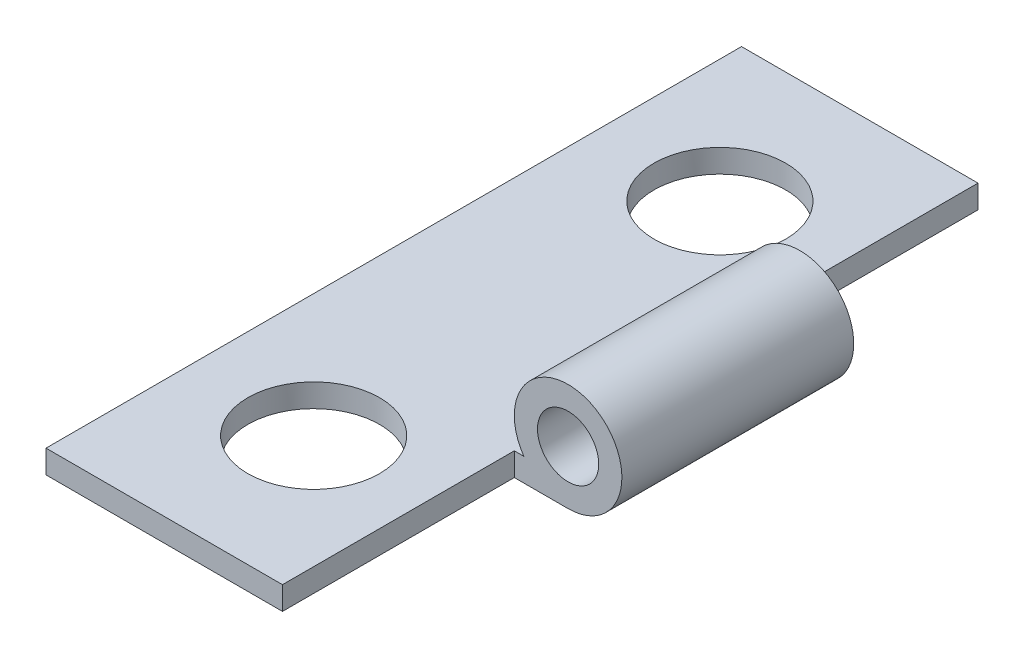
ISO-10303-21;
HEADER;
FILE_DESCRIPTION(('STEP AP214'),'2;1');
FILE_NAME('part.step','',(''),(''),'','','');
FILE_SCHEMA(('AUTOMOTIVE_DESIGN { 1 0 10303 214 1 1 1 1 }'));
ENDSEC;
DATA;
#1=APPLICATION_CONTEXT('core data for automotive mechanical design processes');
#2=APPLICATION_PROTOCOL_DEFINITION('international standard','automotive_design',2000,#1);
#3=PRODUCT_CONTEXT('',#1,'mechanical');
#4=PRODUCT('Part','Part','',(#3));
#5=PRODUCT_RELATED_PRODUCT_CATEGORY('part','',(#4));
#6=PRODUCT_DEFINITION_FORMATION('','',#4);
#7=PRODUCT_DEFINITION_CONTEXT('part definition',#1,'design');
#8=PRODUCT_DEFINITION('design','',#6,#7);
#9=PRODUCT_DEFINITION_SHAPE('','',#8);
#10=(LENGTH_UNIT() NAMED_UNIT(*) SI_UNIT(.MILLI.,.METRE.));
#11=(NAMED_UNIT(*) PLANE_ANGLE_UNIT() SI_UNIT($,.RADIAN.));
#12=(NAMED_UNIT(*) SI_UNIT($,.STERADIAN.) SOLID_ANGLE_UNIT());
#13=UNCERTAINTY_MEASURE_WITH_UNIT(LENGTH_MEASURE(1.E-05),#10,'distance_accuracy_value','');
#14=(GEOMETRIC_REPRESENTATION_CONTEXT(3) GLOBAL_UNCERTAINTY_ASSIGNED_CONTEXT((#13)) GLOBAL_UNIT_ASSIGNED_CONTEXT((#10,
#11,#12)) REPRESENTATION_CONTEXT('',''));
#15=CARTESIAN_POINT('',(0.,0.,0.));
#16=DIRECTION('',(0.,0.,1.));
#17=DIRECTION('',(1.,0.,0.));
#18=AXIS2_PLACEMENT_3D('',#15,#16,#17);
#19=CARTESIAN_POINT('',(-3.0846776,3.10992480641689,19.05));
#20=DIRECTION('',(0.,0.,-1.));
#21=DIRECTION('',(-1.,0.,0.));
#22=AXIS2_PLACEMENT_3D('',#19,#20,#21);
#23=CYLINDRICAL_SURFACE('',#22,1.4732);
#24=CARTESIAN_POINT('',(-3.0846776,3.10992480641689,6.35000000000001));
#25=DIRECTION('',(0.,0.,1.));
#26=DIRECTION('',(1.,0.,0.));
#27=AXIS2_PLACEMENT_3D('',#24,#25,#26);
#28=CIRCLE('',#27,1.4732);
#29=CARTESIAN_POINT('',(-3.0846776,1.63672480641689,6.35000000000001));
#30=VERTEX_POINT('',#29);
#31=CARTESIAN_POINT('',(-4.29618038579952,2.27172480641689,6.35000000000001));
#32=VERTEX_POINT('',#31);
#33=EDGE_CURVE('E140',#30,#32,#28,.T.);
#34=ORIENTED_EDGE('',*,*,#33,.T.);
#35=DIRECTION('',(0.,0.,-1.));
#36=VECTOR('',#35,1.);
#37=CARTESIAN_POINT('',(-4.29618038579952,2.27172480641689,19.05));
#38=LINE('',#37,#36);
#39=CARTESIAN_POINT('',(-4.29618038579952,2.27172480641689,12.7));
#40=VERTEX_POINT('',#39);
#41=EDGE_CURVE('E170',#40,#32,#38,.T.);
#42=ORIENTED_EDGE('',*,*,#41,.F.);
#43=CARTESIAN_POINT('',(-3.0846776,3.10992480641689,12.7));
#44=DIRECTION('',(0.,0.,-1.));
#45=DIRECTION('',(-1.,0.,0.));
#46=AXIS2_PLACEMENT_3D('',#43,#44,#45);
#47=CIRCLE('',#46,1.4732);
#48=CARTESIAN_POINT('',(-3.0846776,1.63672480641689,12.7));
#49=VERTEX_POINT('',#48);
#50=EDGE_CURVE('E63',#40,#49,#47,.T.);
#51=ORIENTED_EDGE('',*,*,#50,.T.);
#52=DIRECTION('',(0.,0.,-1.));
#53=VECTOR('',#52,1.);
#54=CARTESIAN_POINT('',(-3.0846776,1.63672480641689,19.05));
#55=LINE('',#54,#53);
#56=EDGE_CURVE('E129',#49,#30,#55,.T.);
#57=ORIENTED_EDGE('',*,*,#56,.T.);
#58=EDGE_LOOP('',(#34,#42,#51,#57));
#59=FACE_BOUND('',#58,.T.);
#60=ADVANCED_FACE('F39',(#59),#23,.T.);
#61=CARTESIAN_POINT('',(-3.0846776,3.10992480641689,19.05));
#62=DIRECTION('',(0.,0.,1.));
#63=DIRECTION('',(1.,0.,0.));
#64=AXIS2_PLACEMENT_3D('',#61,#62,#63);
#65=PLANE('',#64);
#66=DIRECTION('',(0.,1.,0.));
#67=VECTOR('',#66,1.);
#68=CARTESIAN_POINT('',(-4.5578776,-48.5282751935831,19.05));
#69=LINE('',#68,#67);
#70=CARTESIAN_POINT('',(-4.5578776,1.63672480641688,19.05));
#71=VERTEX_POINT('',#70);
#72=CARTESIAN_POINT('',(-4.5578776,2.27172480641689,19.05));
#73=VERTEX_POINT('',#72);
#74=EDGE_CURVE('E112',#71,#73,#69,.T.);
#75=ORIENTED_EDGE('',*,*,#74,.T.);
#76=DIRECTION('',(-1.,0.,0.));
#77=VECTOR('',#76,1.);
#78=CARTESIAN_POINT('',(-11.0348776,2.27172480641689,19.05));
#79=LINE('',#78,#77);
#80=CARTESIAN_POINT('',(-11.0348776,2.27172480641689,19.05));
#81=VERTEX_POINT('',#80);
#82=EDGE_CURVE('E155',#73,#81,#79,.T.);
#83=ORIENTED_EDGE('',*,*,#82,.T.);
#84=DIRECTION('',(0.,-1.,0.));
#85=VECTOR('',#84,1.);
#86=CARTESIAN_POINT('',(-11.0348776,1.63672480641689,19.05));
#87=LINE('',#86,#85);
#88=CARTESIAN_POINT('',(-11.0348776,1.63672480641689,19.05));
#89=VERTEX_POINT('',#88);
#90=EDGE_CURVE('E158',#81,#89,#87,.T.);
#91=ORIENTED_EDGE('',*,*,#90,.T.);
#92=DIRECTION('',(1.,0.,0.));
#93=VECTOR('',#92,1.);
#94=CARTESIAN_POINT('',(-11.0348776,1.63672480641689,19.05));
#95=LINE('',#94,#93);
#96=EDGE_CURVE('E153',#89,#71,#95,.T.);
#97=ORIENTED_EDGE('',*,*,#96,.T.);
#98=EDGE_LOOP('',(#75,#83,#91,#97));
#99=FACE_BOUND('',#98,.T.);
#100=ADVANCED_FACE('F185',(#99),#65,.T.);
#101=CARTESIAN_POINT('',(-3.0846776,3.10992480641689,0.));
#102=DIRECTION('',(0.,0.,1.));
#103=DIRECTION('',(1.,0.,0.));
#104=AXIS2_PLACEMENT_3D('',#101,#102,#103);
#105=PLANE('',#104);
#106=DIRECTION('',(-1.,0.,0.));
#107=VECTOR('',#106,1.);
#108=CARTESIAN_POINT('',(-11.0348776,2.27172480641689,0.));
#109=LINE('',#108,#107);
#110=CARTESIAN_POINT('',(-4.5578776,2.27172480641689,0.));
#111=VERTEX_POINT('',#110);
#112=CARTESIAN_POINT('',(-11.0348776,2.27172480641689,0.));
#113=VERTEX_POINT('',#112);
#114=EDGE_CURVE('E162',#111,#113,#109,.T.);
#115=ORIENTED_EDGE('',*,*,#114,.F.);
#116=DIRECTION('',(0.,1.,0.));
#117=VECTOR('',#116,1.);
#118=CARTESIAN_POINT('',(-4.5578776,-48.5282751935831,0.));
#119=LINE('',#118,#117);
#120=CARTESIAN_POINT('',(-4.5578776,1.63672480641688,0.));
#121=VERTEX_POINT('',#120);
#122=EDGE_CURVE('E123',#121,#111,#119,.T.);
#123=ORIENTED_EDGE('',*,*,#122,.F.);
#124=DIRECTION('',(1.,0.,0.));
#125=VECTOR('',#124,1.);
#126=CARTESIAN_POINT('',(-11.0348776,1.63672480641689,0.));
#127=LINE('',#126,#125);
#128=CARTESIAN_POINT('',(-11.0348776,1.63672480641689,0.));
#129=VERTEX_POINT('',#128);
#130=EDGE_CURVE('E152',#129,#121,#127,.T.);
#131=ORIENTED_EDGE('',*,*,#130,.F.);
#132=DIRECTION('',(0.,-1.,0.));
#133=VECTOR('',#132,1.);
#134=CARTESIAN_POINT('',(-11.0348776,1.63672480641689,0.));
#135=LINE('',#134,#133);
#136=EDGE_CURVE('E156',#113,#129,#135,.T.);
#137=ORIENTED_EDGE('',*,*,#136,.F.);
#138=EDGE_LOOP('',(#115,#123,#131,#137));
#139=FACE_BOUND('',#138,.T.);
#140=ADVANCED_FACE('F196',(#139),#105,.F.);
#141=CARTESIAN_POINT('',(-11.0348776,1.63672480641689,19.05));
#142=DIRECTION('',(0.,1.,0.));
#143=DIRECTION('',(0.,0.,1.));
#144=AXIS2_PLACEMENT_3D('',#141,#142,#143);
#145=PLANE('',#144);
#146=CARTESIAN_POINT('',(-7.66552899289976,1.63672480641688,15.0876));
#147=DIRECTION('',(0.,1.,0.));
#148=DIRECTION('',(0.,0.,1.));
#149=AXIS2_PLACEMENT_3D('',#146,#147,#148);
#150=CIRCLE('',#149,1.8034);
#151=CARTESIAN_POINT('',(-7.66552899289976,1.63672480641688,16.891));
#152=VERTEX_POINT('',#151);
#153=EDGE_CURVE('E149',#152,#152,#150,.T.);
#154=ORIENTED_EDGE('',*,*,#153,.T.);
#155=EDGE_LOOP('',(#154));
#156=FACE_BOUND('',#155,.T.);
#157=CARTESIAN_POINT('',(-7.66552899289976,1.63672480641688,3.9624));
#158=DIRECTION('',(0.,1.,0.));
#159=DIRECTION('',(0.,0.,1.));
#160=AXIS2_PLACEMENT_3D('',#157,#158,#159);
#161=CIRCLE('',#160,1.8034);
#162=CARTESIAN_POINT('',(-7.66552899289976,1.63672480641688,5.7658));
#163=VERTEX_POINT('',#162);
#164=EDGE_CURVE('E118',#163,#163,#161,.T.);
#165=ORIENTED_EDGE('',*,*,#164,.T.);
#166=EDGE_LOOP('',(#165));
#167=FACE_BOUND('',#166,.T.);
#168=ORIENTED_EDGE('',*,*,#130,.T.);
#169=DIRECTION('',(0.,0.,1.));
#170=VECTOR('',#169,1.);
#171=CARTESIAN_POINT('',(-4.5578776,1.63672480641689,19.05));
#172=LINE('',#171,#170);
#173=CARTESIAN_POINT('',(-4.5578776,1.63672480641688,6.35000000000001));
#174=VERTEX_POINT('',#173);
#175=EDGE_CURVE('E117',#121,#174,#172,.T.);
#176=ORIENTED_EDGE('',*,*,#175,.T.);
#177=DIRECTION('',(1.,0.,0.));
#178=VECTOR('',#177,1.);
#179=CARTESIAN_POINT('',(-11.0348776,1.63672480641689,6.35000000000001));
#180=LINE('',#179,#178);
#181=EDGE_CURVE('E142',#174,#30,#180,.T.);
#182=ORIENTED_EDGE('',*,*,#181,.T.);
#183=ORIENTED_EDGE('',*,*,#56,.F.);
#184=DIRECTION('',(-1.,0.,0.));
#185=VECTOR('',#184,1.);
#186=CARTESIAN_POINT('',(-11.0348776,1.63672480641689,12.7));
#187=LINE('',#186,#185);
#188=CARTESIAN_POINT('',(-4.5578776,1.63672480641688,12.7));
#189=VERTEX_POINT('',#188);
#190=EDGE_CURVE('E121',#49,#189,#187,.T.);
#191=ORIENTED_EDGE('',*,*,#190,.T.);
#192=DIRECTION('',(0.,0.,1.));
#193=VECTOR('',#192,1.);
#194=CARTESIAN_POINT('',(-4.5578776,1.63672480641689,19.05));
#195=LINE('',#194,#193);
#196=EDGE_CURVE('E106',#189,#71,#195,.T.);
#197=ORIENTED_EDGE('',*,*,#196,.T.);
#198=ORIENTED_EDGE('',*,*,#96,.F.);
#199=DIRECTION('',(0.,0.,-1.));
#200=VECTOR('',#199,1.);
#201=CARTESIAN_POINT('',(-11.0348776,1.63672480641689,19.05));
#202=LINE('',#201,#200);
#203=EDGE_CURVE('E160',#89,#129,#202,.T.);
#204=ORIENTED_EDGE('',*,*,#203,.T.);
#205=EDGE_LOOP('',(#168,#176,#182,#183,#191,#197,#198,#204));
#206=FACE_BOUND('',#205,.T.);
#207=ADVANCED_FACE('F41',(#156,#167,#206),#145,.F.);
#208=CARTESIAN_POINT('',(-11.0348776,2.27172480641689,19.05));
#209=DIRECTION('',(0.,-1.,0.));
#210=DIRECTION('',(0.,0.,-1.));
#211=AXIS2_PLACEMENT_3D('',#208,#209,#210);
#212=PLANE('',#211);
#213=CARTESIAN_POINT('',(-7.66552899289976,2.27172480641689,15.0876));
#214=DIRECTION('',(0.,-1.,0.));
#215=DIRECTION('',(0.,0.,-1.));
#216=AXIS2_PLACEMENT_3D('',#213,#214,#215);
#217=CIRCLE('',#216,1.8034);
#218=CARTESIAN_POINT('',(-7.66552899289976,2.27172480641689,13.2842));
#219=VERTEX_POINT('',#218);
#220=EDGE_CURVE('E43',#219,#219,#217,.T.);
#221=ORIENTED_EDGE('',*,*,#220,.T.);
#222=EDGE_LOOP('',(#221));
#223=FACE_BOUND('',#222,.T.);
#224=CARTESIAN_POINT('',(-7.66552899289976,2.27172480641689,3.9624));
#225=DIRECTION('',(0.,-1.,0.));
#226=DIRECTION('',(0.,0.,-1.));
#227=AXIS2_PLACEMENT_3D('',#224,#225,#226);
#228=CIRCLE('',#227,1.8034);
#229=CARTESIAN_POINT('',(-7.66552899289976,2.27172480641689,2.159));
#230=VERTEX_POINT('',#229);
#231=EDGE_CURVE('E144',#230,#230,#228,.T.);
#232=ORIENTED_EDGE('',*,*,#231,.T.);
#233=EDGE_LOOP('',(#232));
#234=FACE_BOUND('',#233,.T.);
#235=DIRECTION('',(-1.,0.,0.));
#236=VECTOR('',#235,1.);
#237=CARTESIAN_POINT('',(-11.0348776,2.27172480641689,6.35000000000001));
#238=LINE('',#237,#236);
#239=CARTESIAN_POINT('',(-4.5578776,2.27172480641689,6.35000000000001));
#240=VERTEX_POINT('',#239);
#241=EDGE_CURVE('E133',#32,#240,#238,.T.);
#242=ORIENTED_EDGE('',*,*,#241,.T.);
#243=DIRECTION('',(0.,0.,-1.));
#244=VECTOR('',#243,1.);
#245=CARTESIAN_POINT('',(-4.5578776,2.27172480641689,19.05));
#246=LINE('',#245,#244);
#247=EDGE_CURVE('E11',#240,#111,#246,.T.);
#248=ORIENTED_EDGE('',*,*,#247,.T.);
#249=ORIENTED_EDGE('',*,*,#114,.T.);
#250=DIRECTION('',(0.,0.,-1.));
#251=VECTOR('',#250,1.);
#252=CARTESIAN_POINT('',(-11.0348776,2.27172480641689,19.05));
#253=LINE('',#252,#251);
#254=EDGE_CURVE('E167',#81,#113,#253,.T.);
#255=ORIENTED_EDGE('',*,*,#254,.F.);
#256=ORIENTED_EDGE('',*,*,#82,.F.);
#257=DIRECTION('',(0.,0.,-1.));
#258=VECTOR('',#257,1.);
#259=CARTESIAN_POINT('',(-4.5578776,2.27172480641689,19.05));
#260=LINE('',#259,#258);
#261=CARTESIAN_POINT('',(-4.5578776,2.27172480641689,12.7));
#262=VERTEX_POINT('',#261);
#263=EDGE_CURVE('E48',#73,#262,#260,.T.);
#264=ORIENTED_EDGE('',*,*,#263,.T.);
#265=DIRECTION('',(1.,0.,0.));
#266=VECTOR('',#265,1.);
#267=CARTESIAN_POINT('',(-11.0348776,2.27172480641689,12.7));
#268=LINE('',#267,#266);
#269=EDGE_CURVE('E122',#262,#40,#268,.T.);
#270=ORIENTED_EDGE('',*,*,#269,.T.);
#271=ORIENTED_EDGE('',*,*,#41,.T.);
#272=EDGE_LOOP('',(#242,#248,#249,#255,#256,#264,#270,#271));
#273=FACE_BOUND('',#272,.T.);
#274=ADVANCED_FACE('F181',(#223,#234,#273),#212,.F.);
#275=CARTESIAN_POINT('',(-11.0348776,1.63672480641689,19.05));
#276=DIRECTION('',(1.,0.,0.));
#277=DIRECTION('',(0.,0.,-1.));
#278=AXIS2_PLACEMENT_3D('',#275,#276,#277);
#279=PLANE('',#278);
#280=ORIENTED_EDGE('',*,*,#136,.T.);
#281=ORIENTED_EDGE('',*,*,#203,.F.);
#282=ORIENTED_EDGE('',*,*,#90,.F.);
#283=ORIENTED_EDGE('',*,*,#254,.T.);
#284=EDGE_LOOP('',(#280,#281,#282,#283));
#285=FACE_BOUND('',#284,.T.);
#286=ADVANCED_FACE('F199',(#285),#279,.F.);
#287=CARTESIAN_POINT('',(-4.5578776,-48.5282751935831,19.05));
#288=DIRECTION('',(-1.,0.,0.));
#289=DIRECTION('',(0.,0.,1.));
#290=AXIS2_PLACEMENT_3D('',#287,#288,#289);
#291=PLANE('',#290);
#292=DIRECTION('',(0.,1.,0.));
#293=VECTOR('',#292,1.);
#294=CARTESIAN_POINT('',(-4.5578776,-48.5282751935831,12.7));
#295=LINE('',#294,#293);
#296=EDGE_CURVE('E109',#189,#262,#295,.T.);
#297=ORIENTED_EDGE('',*,*,#296,.T.);
#298=ORIENTED_EDGE('',*,*,#263,.F.);
#299=ORIENTED_EDGE('',*,*,#74,.F.);
#300=ORIENTED_EDGE('',*,*,#196,.F.);
#301=EDGE_LOOP('',(#297,#298,#299,#300));
#302=FACE_BOUND('',#301,.T.);
#303=ADVANCED_FACE('F108',(#302),#291,.F.);
#304=CARTESIAN_POINT('',(-1.6114776,-48.5282751935831,12.7));
#305=DIRECTION('',(0.,0.,-1.));
#306=DIRECTION('',(-1.,0.,0.));
#307=AXIS2_PLACEMENT_3D('',#304,#305,#306);
#308=PLANE('',#307);
#309=CARTESIAN_POINT('',(-3.0846776,3.10992480641689,12.7));
#310=DIRECTION('',(0.,0.,-1.));
#311=DIRECTION('',(-1.,0.,0.));
#312=AXIS2_PLACEMENT_3D('',#309,#310,#311);
#313=CIRCLE('',#312,0.8382);
#314=CARTESIAN_POINT('',(-3.9228776,3.10992480641689,12.7));
#315=VERTEX_POINT('',#314);
#316=EDGE_CURVE('E174',#315,#315,#313,.T.);
#317=ORIENTED_EDGE('',*,*,#316,.T.);
#318=EDGE_LOOP('',(#317));
#319=FACE_BOUND('',#318,.T.);
#320=ORIENTED_EDGE('',*,*,#50,.F.);
#321=ORIENTED_EDGE('',*,*,#269,.F.);
#322=ORIENTED_EDGE('',*,*,#296,.F.);
#323=ORIENTED_EDGE('',*,*,#190,.F.);
#324=EDGE_LOOP('',(#320,#321,#322,#323));
#325=FACE_BOUND('',#324,.T.);
#326=ADVANCED_FACE('F120',(#319,#325),#308,.F.);
#327=CARTESIAN_POINT('',(-4.5578776,-48.5282751935831,6.35000000000001));
#328=DIRECTION('',(-1.,0.,0.));
#329=DIRECTION('',(0.,0.,1.));
#330=AXIS2_PLACEMENT_3D('',#327,#328,#329);
#331=PLANE('',#330);
#332=ORIENTED_EDGE('',*,*,#122,.T.);
#333=ORIENTED_EDGE('',*,*,#247,.F.);
#334=DIRECTION('',(0.,1.,0.));
#335=VECTOR('',#334,1.);
#336=CARTESIAN_POINT('',(-4.5578776,-48.5282751935831,6.35000000000001));
#337=LINE('',#336,#335);
#338=EDGE_CURVE('E55',#174,#240,#337,.T.);
#339=ORIENTED_EDGE('',*,*,#338,.F.);
#340=ORIENTED_EDGE('',*,*,#175,.F.);
#341=EDGE_LOOP('',(#332,#333,#339,#340));
#342=FACE_BOUND('',#341,.T.);
#343=ADVANCED_FACE('F191',(#342),#331,.F.);
#344=CARTESIAN_POINT('',(-4.5578776,-48.5282751935831,6.35000000000001));
#345=DIRECTION('',(0.,0.,1.));
#346=DIRECTION('',(1.,0.,0.));
#347=AXIS2_PLACEMENT_3D('',#344,#345,#346);
#348=PLANE('',#347);
#349=CARTESIAN_POINT('',(-3.0846776,3.10992480641689,6.35000000000001));
#350=DIRECTION('',(0.,0.,1.));
#351=DIRECTION('',(1.,0.,0.));
#352=AXIS2_PLACEMENT_3D('',#349,#350,#351);
#353=CIRCLE('',#352,0.8382);
#354=CARTESIAN_POINT('',(-2.2464776,3.10992480641689,6.35000000000001));
#355=VERTEX_POINT('',#354);
#356=EDGE_CURVE('E130',#355,#355,#353,.T.);
#357=ORIENTED_EDGE('',*,*,#356,.T.);
#358=EDGE_LOOP('',(#357));
#359=FACE_BOUND('',#358,.T.);
#360=ORIENTED_EDGE('',*,*,#338,.T.);
#361=ORIENTED_EDGE('',*,*,#241,.F.);
#362=ORIENTED_EDGE('',*,*,#33,.F.);
#363=ORIENTED_EDGE('',*,*,#181,.F.);
#364=EDGE_LOOP('',(#360,#361,#362,#363));
#365=FACE_BOUND('',#364,.T.);
#366=ADVANCED_FACE('F202',(#359,#365),#348,.F.);
#367=CARTESIAN_POINT('',(-7.66552899289976,-48.5282751935831,3.9624));
#368=DIRECTION('',(0.,1.,0.));
#369=DIRECTION('',(0.,0.,1.));
#370=AXIS2_PLACEMENT_3D('',#367,#368,#369);
#371=CYLINDRICAL_SURFACE('',#370,1.8034);
#372=ORIENTED_EDGE('',*,*,#231,.F.);
#373=EDGE_LOOP('',(#372));
#374=FACE_BOUND('',#373,.T.);
#375=ORIENTED_EDGE('',*,*,#164,.F.);
#376=EDGE_LOOP('',(#375));
#377=FACE_BOUND('',#376,.T.);
#378=ADVANCED_FACE('F204',(#374,#377),#371,.F.);
#379=CARTESIAN_POINT('',(-7.66552899289976,-48.5282751935831,15.0876));
#380=DIRECTION('',(0.,1.,0.));
#381=DIRECTION('',(0.,0.,1.));
#382=AXIS2_PLACEMENT_3D('',#379,#380,#381);
#383=CYLINDRICAL_SURFACE('',#382,1.8034);
#384=ORIENTED_EDGE('',*,*,#220,.F.);
#385=EDGE_LOOP('',(#384));
#386=FACE_BOUND('',#385,.T.);
#387=ORIENTED_EDGE('',*,*,#153,.F.);
#388=EDGE_LOOP('',(#387));
#389=FACE_BOUND('',#388,.T.);
#390=ADVANCED_FACE('F211',(#386,#389),#383,.F.);
#391=CARTESIAN_POINT('',(-3.0846776,3.10992480641689,19.05));
#392=DIRECTION('',(0.,0.,-1.));
#393=DIRECTION('',(-1.,0.,0.));
#394=AXIS2_PLACEMENT_3D('',#391,#392,#393);
#395=CYLINDRICAL_SURFACE('',#394,0.8382);
#396=ORIENTED_EDGE('',*,*,#356,.F.);
#397=EDGE_LOOP('',(#396));
#398=FACE_BOUND('',#397,.T.);
#399=ORIENTED_EDGE('',*,*,#316,.F.);
#400=EDGE_LOOP('',(#399));
#401=FACE_BOUND('',#400,.T.);
#402=ADVANCED_FACE('F228',(#398,#401),#395,.F.);
#403=CLOSED_SHELL('',(#60,#100,#140,#207,#274,#286,#303,#326,#343,#366,#378,#390,#402));
#404=MANIFOLD_SOLID_BREP('B2',#403);
#405=ADVANCED_BREP_SHAPE_REPRESENTATION('',(#18,#404),#14);
#406=SHAPE_DEFINITION_REPRESENTATION(#9,#405);
ENDSEC;
END-ISO-10303-21;
